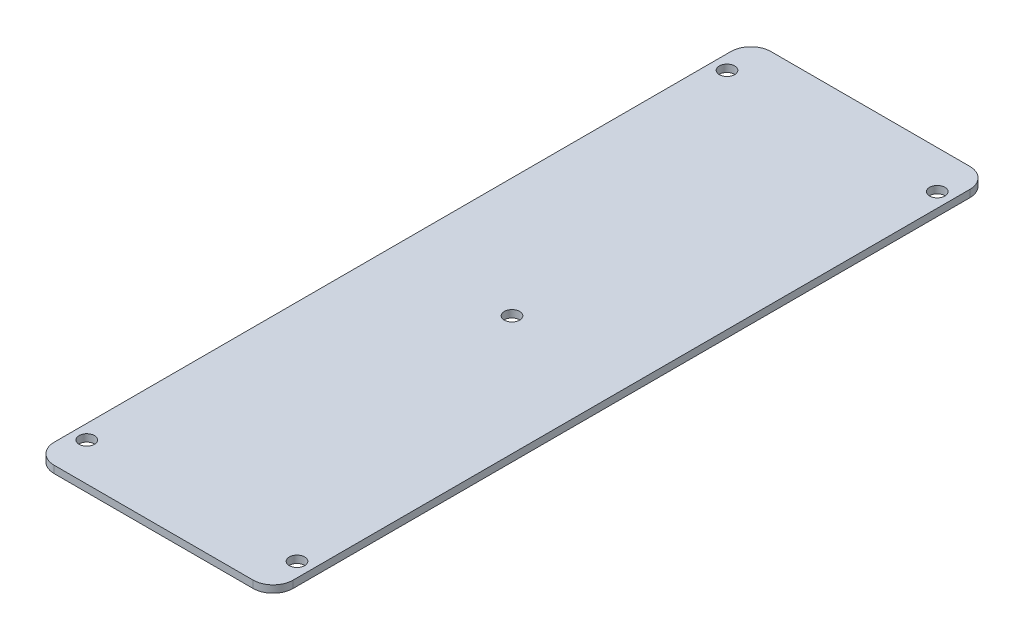
ISO-10303-21;
HEADER;
FILE_DESCRIPTION(('STEP AP214'),'2;1');
FILE_NAME('part.step','',(''),(''),'','','');
FILE_SCHEMA(('AUTOMOTIVE_DESIGN { 1 0 10303 214 1 1 1 1 }'));
ENDSEC;
DATA;
#1=APPLICATION_CONTEXT('core data for automotive mechanical design processes');
#2=APPLICATION_PROTOCOL_DEFINITION('international standard','automotive_design',2000,#1);
#3=PRODUCT_CONTEXT('',#1,'mechanical');
#4=PRODUCT('Part','Part','',(#3));
#5=PRODUCT_RELATED_PRODUCT_CATEGORY('part','',(#4));
#6=PRODUCT_DEFINITION_FORMATION('','',#4);
#7=PRODUCT_DEFINITION_CONTEXT('part definition',#1,'design');
#8=PRODUCT_DEFINITION('design','',#6,#7);
#9=PRODUCT_DEFINITION_SHAPE('','',#8);
#10=(LENGTH_UNIT() NAMED_UNIT(*) SI_UNIT(.MILLI.,.METRE.));
#11=(NAMED_UNIT(*) PLANE_ANGLE_UNIT() SI_UNIT($,.RADIAN.));
#12=(NAMED_UNIT(*) SI_UNIT($,.STERADIAN.) SOLID_ANGLE_UNIT());
#13=UNCERTAINTY_MEASURE_WITH_UNIT(LENGTH_MEASURE(1.E-05),#10,'distance_accuracy_value','');
#14=(GEOMETRIC_REPRESENTATION_CONTEXT(3) GLOBAL_UNCERTAINTY_ASSIGNED_CONTEXT((#13)) GLOBAL_UNIT_ASSIGNED_CONTEXT((#10,
#11,#12)) REPRESENTATION_CONTEXT('',''));
#15=CARTESIAN_POINT('',(0.,0.,0.));
#16=DIRECTION('',(0.,0.,1.));
#17=DIRECTION('',(1.,0.,0.));
#18=AXIS2_PLACEMENT_3D('',#15,#16,#17);
#19=CARTESIAN_POINT('',(3.00000000000004,-4.5254833995939,142.));
#20=DIRECTION('',(0.,1.,0.));
#21=DIRECTION('',(0.,0.,1.));
#22=AXIS2_PLACEMENT_3D('',#19,#20,#21);
#23=CYLINDRICAL_SURFACE('',#22,1.6);
#24=CARTESIAN_POINT('',(3.00000000000004,0.,142.));
#25=DIRECTION('',(0.,1.,0.));
#26=DIRECTION('',(0.,0.,1.));
#27=AXIS2_PLACEMENT_3D('',#24,#25,#26);
#28=CIRCLE('',#27,1.6);
#29=CARTESIAN_POINT('',(3.00000000000004,0.,143.6));
#30=VERTEX_POINT('',#29);
#31=EDGE_CURVE('E145',#30,#30,#28,.F.);
#32=ORIENTED_EDGE('',*,*,#31,.T.);
#33=EDGE_LOOP('',(#32));
#34=FACE_BOUND('',#33,.T.);
#35=CARTESIAN_POINT('',(3.00000000000004,1.524,142.));
#36=DIRECTION('',(0.,1.,0.));
#37=DIRECTION('',(0.,0.,1.));
#38=AXIS2_PLACEMENT_3D('',#35,#36,#37);
#39=CIRCLE('',#38,1.6);
#40=CARTESIAN_POINT('',(3.00000000000004,1.524,143.6));
#41=VERTEX_POINT('',#40);
#42=EDGE_CURVE('E148',#41,#41,#39,.T.);
#43=ORIENTED_EDGE('',*,*,#42,.T.);
#44=EDGE_LOOP('',(#43));
#45=FACE_BOUND('',#44,.T.);
#46=ADVANCED_FACE('F38',(#34,#45),#23,.F.);
#47=CARTESIAN_POINT('',(47.,-4.5254833995939,142.));
#48=DIRECTION('',(0.,1.,0.));
#49=DIRECTION('',(0.,0.,1.));
#50=AXIS2_PLACEMENT_3D('',#47,#48,#49);
#51=CYLINDRICAL_SURFACE('',#50,1.6);
#52=CARTESIAN_POINT('',(47.,0.,142.));
#53=DIRECTION('',(0.,1.,0.));
#54=DIRECTION('',(0.,0.,1.));
#55=AXIS2_PLACEMENT_3D('',#52,#53,#54);
#56=CIRCLE('',#55,1.6);
#57=CARTESIAN_POINT('',(47.,0.,143.6));
#58=VERTEX_POINT('',#57);
#59=EDGE_CURVE('E138',#58,#58,#56,.F.);
#60=ORIENTED_EDGE('',*,*,#59,.T.);
#61=EDGE_LOOP('',(#60));
#62=FACE_BOUND('',#61,.T.);
#63=CARTESIAN_POINT('',(47.,1.524,142.));
#64=DIRECTION('',(0.,1.,0.));
#65=DIRECTION('',(0.,0.,1.));
#66=AXIS2_PLACEMENT_3D('',#63,#64,#65);
#67=CIRCLE('',#66,1.6);
#68=CARTESIAN_POINT('',(47.,1.524,143.6));
#69=VERTEX_POINT('',#68);
#70=EDGE_CURVE('E141',#69,#69,#67,.T.);
#71=ORIENTED_EDGE('',*,*,#70,.T.);
#72=EDGE_LOOP('',(#71));
#73=FACE_BOUND('',#72,.T.);
#74=ADVANCED_FACE('F231',(#62,#73),#51,.F.);
#75=CARTESIAN_POINT('',(0.,1.524,0.));
#76=DIRECTION('',(1.,0.,0.));
#77=DIRECTION('',(0.,0.,-1.));
#78=AXIS2_PLACEMENT_3D('',#75,#76,#77);
#79=PLANE('',#78);
#80=DIRECTION('',(0.,0.,1.));
#81=VECTOR('',#80,1.);
#82=CARTESIAN_POINT('',(0.,0.,0.));
#83=LINE('',#82,#81);
#84=CARTESIAN_POINT('',(0.,0.,4.191));
#85=VERTEX_POINT('',#84);
#86=CARTESIAN_POINT('',(0.,0.,145.809));
#87=VERTEX_POINT('',#86);
#88=EDGE_CURVE('E134',#85,#87,#83,.T.);
#89=ORIENTED_EDGE('',*,*,#88,.T.);
#90=DIRECTION('',(0.,-1.,0.));
#91=VECTOR('',#90,1.);
#92=CARTESIAN_POINT('',(0.,1.524,145.809));
#93=LINE('',#92,#91);
#94=CARTESIAN_POINT('',(0.,1.524,145.809));
#95=VERTEX_POINT('',#94);
#96=EDGE_CURVE('E169',#87,#95,#93,.F.);
#97=ORIENTED_EDGE('',*,*,#96,.T.);
#98=DIRECTION('',(0.,0.,1.));
#99=VECTOR('',#98,1.);
#100=CARTESIAN_POINT('',(0.,1.524,0.));
#101=LINE('',#100,#99);
#102=CARTESIAN_POINT('',(0.,1.524,4.191));
#103=VERTEX_POINT('',#102);
#104=EDGE_CURVE('E132',#103,#95,#101,.T.);
#105=ORIENTED_EDGE('',*,*,#104,.F.);
#106=DIRECTION('',(0.,-1.,0.));
#107=VECTOR('',#106,1.);
#108=CARTESIAN_POINT('',(0.,1.524,4.191));
#109=LINE('',#108,#107);
#110=EDGE_CURVE('E166',#103,#85,#109,.T.);
#111=ORIENTED_EDGE('',*,*,#110,.T.);
#112=EDGE_LOOP('',(#89,#97,#105,#111));
#113=FACE_BOUND('',#112,.T.);
#114=ADVANCED_FACE('F182',(#113),#79,.F.);
#115=CARTESIAN_POINT('',(0.,1.524,150.));
#116=DIRECTION('',(0.,0.,-1.));
#117=DIRECTION('',(-1.,0.,0.));
#118=AXIS2_PLACEMENT_3D('',#115,#116,#117);
#119=PLANE('',#118);
#120=DIRECTION('',(1.,0.,0.));
#121=VECTOR('',#120,1.);
#122=CARTESIAN_POINT('',(0.,0.,150.));
#123=LINE('',#122,#121);
#124=CARTESIAN_POINT('',(4.19100000000002,0.,150.));
#125=VERTEX_POINT('',#124);
#126=CARTESIAN_POINT('',(45.809,0.,150.));
#127=VERTEX_POINT('',#126);
#128=EDGE_CURVE('E130',#125,#127,#123,.T.);
#129=ORIENTED_EDGE('',*,*,#128,.T.);
#130=DIRECTION('',(0.,-1.,0.));
#131=VECTOR('',#130,1.);
#132=CARTESIAN_POINT('',(45.809,1.524,150.));
#133=LINE('',#132,#131);
#134=CARTESIAN_POINT('',(45.809,1.524,150.));
#135=VERTEX_POINT('',#134);
#136=EDGE_CURVE('E108',#127,#135,#133,.F.);
#137=ORIENTED_EDGE('',*,*,#136,.T.);
#138=DIRECTION('',(1.,0.,0.));
#139=VECTOR('',#138,1.);
#140=CARTESIAN_POINT('',(0.,1.524,150.));
#141=LINE('',#140,#139);
#142=CARTESIAN_POINT('',(4.19100000000002,1.524,150.));
#143=VERTEX_POINT('',#142);
#144=EDGE_CURVE('E186',#143,#135,#141,.T.);
#145=ORIENTED_EDGE('',*,*,#144,.F.);
#146=DIRECTION('',(0.,-1.,0.));
#147=VECTOR('',#146,1.);
#148=CARTESIAN_POINT('',(4.19100000000002,1.524,150.));
#149=LINE('',#148,#147);
#150=EDGE_CURVE('E113',#143,#125,#149,.T.);
#151=ORIENTED_EDGE('',*,*,#150,.T.);
#152=EDGE_LOOP('',(#129,#137,#145,#151));
#153=FACE_BOUND('',#152,.T.);
#154=ADVANCED_FACE('F272',(#153),#119,.F.);
#155=CARTESIAN_POINT('',(50.,1.524,0.));
#156=DIRECTION('',(-1.,0.,0.));
#157=DIRECTION('',(0.,0.,1.));
#158=AXIS2_PLACEMENT_3D('',#155,#156,#157);
#159=PLANE('',#158);
#160=DIRECTION('',(0.,0.,-1.));
#161=VECTOR('',#160,1.);
#162=CARTESIAN_POINT('',(50.,1.524,0.));
#163=LINE('',#162,#161);
#164=CARTESIAN_POINT('',(50.,1.524,145.809));
#165=VERTEX_POINT('',#164);
#166=CARTESIAN_POINT('',(50.,1.524,4.191));
#167=VERTEX_POINT('',#166);
#168=EDGE_CURVE('E122',#165,#167,#163,.T.);
#169=ORIENTED_EDGE('',*,*,#168,.F.);
#170=DIRECTION('',(0.,-1.,0.));
#171=VECTOR('',#170,1.);
#172=CARTESIAN_POINT('',(50.,1.524,145.809));
#173=LINE('',#172,#171);
#174=CARTESIAN_POINT('',(50.,0.,145.809));
#175=VERTEX_POINT('',#174);
#176=EDGE_CURVE('E107',#165,#175,#173,.T.);
#177=ORIENTED_EDGE('',*,*,#176,.T.);
#178=DIRECTION('',(0.,0.,-1.));
#179=VECTOR('',#178,1.);
#180=CARTESIAN_POINT('',(50.,0.,0.));
#181=LINE('',#180,#179);
#182=CARTESIAN_POINT('',(50.,0.,4.191));
#183=VERTEX_POINT('',#182);
#184=EDGE_CURVE('E120',#175,#183,#181,.T.);
#185=ORIENTED_EDGE('',*,*,#184,.T.);
#186=DIRECTION('',(0.,-1.,0.));
#187=VECTOR('',#186,1.);
#188=CARTESIAN_POINT('',(50.,1.524,4.191));
#189=LINE('',#188,#187);
#190=EDGE_CURVE('E124',#183,#167,#189,.F.);
#191=ORIENTED_EDGE('',*,*,#190,.T.);
#192=EDGE_LOOP('',(#169,#177,#185,#191));
#193=FACE_BOUND('',#192,.T.);
#194=ADVANCED_FACE('F119',(#193),#159,.F.);
#195=CARTESIAN_POINT('',(0.,1.524,0.));
#196=DIRECTION('',(0.,0.,1.));
#197=DIRECTION('',(1.,0.,0.));
#198=AXIS2_PLACEMENT_3D('',#195,#196,#197);
#199=PLANE('',#198);
#200=DIRECTION('',(-1.,0.,0.));
#201=VECTOR('',#200,1.);
#202=CARTESIAN_POINT('',(0.,0.,0.));
#203=LINE('',#202,#201);
#204=CARTESIAN_POINT('',(45.809,0.,0.));
#205=VERTEX_POINT('',#204);
#206=CARTESIAN_POINT('',(4.191,0.,0.));
#207=VERTEX_POINT('',#206);
#208=EDGE_CURVE('E129',#205,#207,#203,.T.);
#209=ORIENTED_EDGE('',*,*,#208,.T.);
#210=DIRECTION('',(0.,-1.,0.));
#211=VECTOR('',#210,1.);
#212=CARTESIAN_POINT('',(4.191,1.524,0.));
#213=LINE('',#212,#211);
#214=CARTESIAN_POINT('',(4.191,1.524,0.));
#215=VERTEX_POINT('',#214);
#216=EDGE_CURVE('E11',#207,#215,#213,.F.);
#217=ORIENTED_EDGE('',*,*,#216,.T.);
#218=DIRECTION('',(-1.,0.,0.));
#219=VECTOR('',#218,1.);
#220=CARTESIAN_POINT('',(0.,1.524,0.));
#221=LINE('',#220,#219);
#222=CARTESIAN_POINT('',(45.809,1.524,0.));
#223=VERTEX_POINT('',#222);
#224=EDGE_CURVE('E142',#223,#215,#221,.T.);
#225=ORIENTED_EDGE('',*,*,#224,.F.);
#226=DIRECTION('',(0.,-1.,0.));
#227=VECTOR('',#226,1.);
#228=CARTESIAN_POINT('',(45.809,1.524,0.));
#229=LINE('',#228,#227);
#230=EDGE_CURVE('E46',#223,#205,#229,.T.);
#231=ORIENTED_EDGE('',*,*,#230,.T.);
#232=EDGE_LOOP('',(#209,#217,#225,#231));
#233=FACE_BOUND('',#232,.T.);
#234=ADVANCED_FACE('F172',(#233),#199,.F.);
#235=CARTESIAN_POINT('',(0.,1.524,0.));
#236=DIRECTION('',(0.,1.,0.));
#237=DIRECTION('',(0.,0.,1.));
#238=AXIS2_PLACEMENT_3D('',#235,#236,#237);
#239=PLANE('',#238);
#240=CARTESIAN_POINT('',(25.,1.524,75.));
#241=DIRECTION('',(0.,1.,0.));
#242=DIRECTION('',(0.,0.,1.));
#243=AXIS2_PLACEMENT_3D('',#240,#241,#242);
#244=CIRCLE('',#243,1.60000000000001);
#245=CARTESIAN_POINT('',(25.,1.524,76.6));
#246=VERTEX_POINT('',#245);
#247=EDGE_CURVE('E212',#246,#246,#244,.T.);
#248=ORIENTED_EDGE('',*,*,#247,.F.);
#249=EDGE_LOOP('',(#248));
#250=FACE_BOUND('',#249,.T.);
#251=CARTESIAN_POINT('',(3.00000000000002,1.524,8.00000000000001));
#252=DIRECTION('',(0.,1.,0.));
#253=DIRECTION('',(0.,0.,1.));
#254=AXIS2_PLACEMENT_3D('',#251,#252,#253);
#255=CIRCLE('',#254,1.6);
#256=CARTESIAN_POINT('',(3.00000000000002,1.524,9.6));
#257=VERTEX_POINT('',#256);
#258=EDGE_CURVE('E200',#257,#257,#255,.T.);
#259=ORIENTED_EDGE('',*,*,#258,.F.);
#260=EDGE_LOOP('',(#259));
#261=FACE_BOUND('',#260,.T.);
#262=CARTESIAN_POINT('',(47.,1.524,8.00000000000001));
#263=DIRECTION('',(0.,1.,0.));
#264=DIRECTION('',(0.,0.,1.));
#265=AXIS2_PLACEMENT_3D('',#262,#263,#264);
#266=CIRCLE('',#265,1.6);
#267=CARTESIAN_POINT('',(47.,1.524,9.6));
#268=VERTEX_POINT('',#267);
#269=EDGE_CURVE('E196',#268,#268,#266,.T.);
#270=ORIENTED_EDGE('',*,*,#269,.F.);
#271=EDGE_LOOP('',(#270));
#272=FACE_BOUND('',#271,.T.);
#273=ORIENTED_EDGE('',*,*,#144,.T.);
#274=CARTESIAN_POINT('',(45.809,1.524,145.809));
#275=DIRECTION('',(0.,1.,0.));
#276=DIRECTION('',(0.,0.,1.));
#277=AXIS2_PLACEMENT_3D('',#274,#275,#276);
#278=CIRCLE('',#277,4.191);
#279=EDGE_CURVE('E164',#135,#165,#278,.T.);
#280=ORIENTED_EDGE('',*,*,#279,.T.);
#281=ORIENTED_EDGE('',*,*,#168,.T.);
#282=CARTESIAN_POINT('',(45.809,1.524,4.191));
#283=DIRECTION('',(0.,1.,0.));
#284=DIRECTION('',(0.,0.,1.));
#285=AXIS2_PLACEMENT_3D('',#282,#283,#284);
#286=CIRCLE('',#285,4.191);
#287=EDGE_CURVE('E58',#167,#223,#286,.T.);
#288=ORIENTED_EDGE('',*,*,#287,.T.);
#289=ORIENTED_EDGE('',*,*,#224,.T.);
#290=CARTESIAN_POINT('',(4.191,1.524,4.191));
#291=DIRECTION('',(0.,1.,0.));
#292=DIRECTION('',(0.,0.,1.));
#293=AXIS2_PLACEMENT_3D('',#290,#291,#292);
#294=CIRCLE('',#293,4.191);
#295=EDGE_CURVE('E160',#215,#103,#294,.T.);
#296=ORIENTED_EDGE('',*,*,#295,.T.);
#297=ORIENTED_EDGE('',*,*,#104,.T.);
#298=CARTESIAN_POINT('',(4.19100000000002,1.524,145.809));
#299=DIRECTION('',(0.,1.,0.));
#300=DIRECTION('',(0.,0.,1.));
#301=AXIS2_PLACEMENT_3D('',#298,#299,#300);
#302=CIRCLE('',#301,4.191);
#303=EDGE_CURVE('E162',#95,#143,#302,.T.);
#304=ORIENTED_EDGE('',*,*,#303,.T.);
#305=EDGE_LOOP('',(#273,#280,#281,#288,#289,#296,#297,#304));
#306=FACE_BOUND('',#305,.T.);
#307=ORIENTED_EDGE('',*,*,#70,.F.);
#308=EDGE_LOOP('',(#307));
#309=FACE_BOUND('',#308,.T.);
#310=ORIENTED_EDGE('',*,*,#42,.F.);
#311=EDGE_LOOP('',(#310));
#312=FACE_BOUND('',#311,.T.);
#313=ADVANCED_FACE('F218',(#250,#261,#272,#306,#309,#312),#239,.T.);
#314=CARTESIAN_POINT('',(0.,0.,0.));
#315=DIRECTION('',(0.,1.,0.));
#316=DIRECTION('',(0.,0.,1.));
#317=AXIS2_PLACEMENT_3D('',#314,#315,#316);
#318=PLANE('',#317);
#319=CARTESIAN_POINT('',(25.,0.,75.));
#320=DIRECTION('',(0.,1.,0.));
#321=DIRECTION('',(0.,0.,1.));
#322=AXIS2_PLACEMENT_3D('',#319,#320,#321);
#323=CIRCLE('',#322,1.60000000000001);
#324=CARTESIAN_POINT('',(25.,0.,76.6));
#325=VERTEX_POINT('',#324);
#326=EDGE_CURVE('E209',#325,#325,#323,.F.);
#327=ORIENTED_EDGE('',*,*,#326,.F.);
#328=EDGE_LOOP('',(#327));
#329=FACE_BOUND('',#328,.T.);
#330=CARTESIAN_POINT('',(3.00000000000002,0.,8.00000000000001));
#331=DIRECTION('',(0.,1.,0.));
#332=DIRECTION('',(0.,0.,1.));
#333=AXIS2_PLACEMENT_3D('',#330,#331,#332);
#334=CIRCLE('',#333,1.6);
#335=CARTESIAN_POINT('',(3.00000000000002,0.,9.6));
#336=VERTEX_POINT('',#335);
#337=EDGE_CURVE('E204',#336,#336,#334,.F.);
#338=ORIENTED_EDGE('',*,*,#337,.F.);
#339=EDGE_LOOP('',(#338));
#340=FACE_BOUND('',#339,.T.);
#341=CARTESIAN_POINT('',(47.,0.,8.00000000000001));
#342=DIRECTION('',(0.,1.,0.));
#343=DIRECTION('',(0.,0.,1.));
#344=AXIS2_PLACEMENT_3D('',#341,#342,#343);
#345=CIRCLE('',#344,1.6);
#346=CARTESIAN_POINT('',(47.,0.,9.6));
#347=VERTEX_POINT('',#346);
#348=EDGE_CURVE('E191',#347,#347,#345,.F.);
#349=ORIENTED_EDGE('',*,*,#348,.F.);
#350=EDGE_LOOP('',(#349));
#351=FACE_BOUND('',#350,.T.);
#352=ORIENTED_EDGE('',*,*,#184,.F.);
#353=CARTESIAN_POINT('',(45.809,0.,145.809));
#354=DIRECTION('',(0.,1.,0.));
#355=DIRECTION('',(0.,0.,1.));
#356=AXIS2_PLACEMENT_3D('',#353,#354,#355);
#357=CIRCLE('',#356,4.191);
#358=EDGE_CURVE('E103',#175,#127,#357,.F.);
#359=ORIENTED_EDGE('',*,*,#358,.T.);
#360=ORIENTED_EDGE('',*,*,#128,.F.);
#361=CARTESIAN_POINT('',(4.19100000000002,0.,145.809));
#362=DIRECTION('',(0.,1.,0.));
#363=DIRECTION('',(0.,0.,1.));
#364=AXIS2_PLACEMENT_3D('',#361,#362,#363);
#365=CIRCLE('',#364,4.191);
#366=EDGE_CURVE('E114',#125,#87,#365,.F.);
#367=ORIENTED_EDGE('',*,*,#366,.T.);
#368=ORIENTED_EDGE('',*,*,#88,.F.);
#369=CARTESIAN_POINT('',(4.191,0.,4.191));
#370=DIRECTION('',(0.,1.,0.));
#371=DIRECTION('',(0.,0.,1.));
#372=AXIS2_PLACEMENT_3D('',#369,#370,#371);
#373=CIRCLE('',#372,4.191);
#374=EDGE_CURVE('E153',#85,#207,#373,.F.);
#375=ORIENTED_EDGE('',*,*,#374,.T.);
#376=ORIENTED_EDGE('',*,*,#208,.F.);
#377=CARTESIAN_POINT('',(45.809,0.,4.191));
#378=DIRECTION('',(0.,1.,0.));
#379=DIRECTION('',(0.,0.,1.));
#380=AXIS2_PLACEMENT_3D('',#377,#378,#379);
#381=CIRCLE('',#380,4.191);
#382=EDGE_CURVE('E123',#205,#183,#381,.F.);
#383=ORIENTED_EDGE('',*,*,#382,.T.);
#384=EDGE_LOOP('',(#352,#359,#360,#367,#368,#375,#376,#383));
#385=FACE_BOUND('',#384,.T.);
#386=ORIENTED_EDGE('',*,*,#59,.F.);
#387=EDGE_LOOP('',(#386));
#388=FACE_BOUND('',#387,.T.);
#389=ORIENTED_EDGE('',*,*,#31,.F.);
#390=EDGE_LOOP('',(#389));
#391=FACE_BOUND('',#390,.T.);
#392=ADVANCED_FACE('F126',(#329,#340,#351,#385,#388,#391),#318,.F.);
#393=CARTESIAN_POINT('',(47.,-4.5254833995939,8.00000000000001));
#394=DIRECTION('',(0.,1.,0.));
#395=DIRECTION('',(0.,0.,1.));
#396=AXIS2_PLACEMENT_3D('',#393,#394,#395);
#397=CYLINDRICAL_SURFACE('',#396,1.6);
#398=ORIENTED_EDGE('',*,*,#348,.T.);
#399=EDGE_LOOP('',(#398));
#400=FACE_BOUND('',#399,.T.);
#401=ORIENTED_EDGE('',*,*,#269,.T.);
#402=EDGE_LOOP('',(#401));
#403=FACE_BOUND('',#402,.T.);
#404=ADVANCED_FACE('F261',(#400,#403),#397,.F.);
#405=CARTESIAN_POINT('',(3.00000000000002,-4.5254833995939,8.00000000000001));
#406=DIRECTION('',(0.,1.,0.));
#407=DIRECTION('',(0.,0.,1.));
#408=AXIS2_PLACEMENT_3D('',#405,#406,#407);
#409=CYLINDRICAL_SURFACE('',#408,1.6);
#410=ORIENTED_EDGE('',*,*,#337,.T.);
#411=EDGE_LOOP('',(#410));
#412=FACE_BOUND('',#411,.T.);
#413=ORIENTED_EDGE('',*,*,#258,.T.);
#414=EDGE_LOOP('',(#413));
#415=FACE_BOUND('',#414,.T.);
#416=ADVANCED_FACE('F244',(#412,#415),#409,.F.);
#417=CARTESIAN_POINT('',(45.809,1.524,145.809));
#418=DIRECTION('',(0.,-1.,0.));
#419=DIRECTION('',(0.,0.,-1.));
#420=AXIS2_PLACEMENT_3D('',#417,#418,#419);
#421=CYLINDRICAL_SURFACE('',#420,4.191);
#422=ORIENTED_EDGE('',*,*,#279,.F.);
#423=ORIENTED_EDGE('',*,*,#136,.F.);
#424=ORIENTED_EDGE('',*,*,#358,.F.);
#425=ORIENTED_EDGE('',*,*,#176,.F.);
#426=EDGE_LOOP('',(#422,#423,#424,#425));
#427=FACE_BOUND('',#426,.T.);
#428=ADVANCED_FACE('F106',(#427),#421,.T.);
#429=CARTESIAN_POINT('',(4.19100000000002,1.524,145.809));
#430=DIRECTION('',(0.,-1.,0.));
#431=DIRECTION('',(0.,0.,-1.));
#432=AXIS2_PLACEMENT_3D('',#429,#430,#431);
#433=CYLINDRICAL_SURFACE('',#432,4.191);
#434=ORIENTED_EDGE('',*,*,#303,.F.);
#435=ORIENTED_EDGE('',*,*,#96,.F.);
#436=ORIENTED_EDGE('',*,*,#366,.F.);
#437=ORIENTED_EDGE('',*,*,#150,.F.);
#438=EDGE_LOOP('',(#434,#435,#436,#437));
#439=FACE_BOUND('',#438,.T.);
#440=ADVANCED_FACE('F243',(#439),#433,.T.);
#441=CARTESIAN_POINT('',(4.191,1.524,4.191));
#442=DIRECTION('',(0.,-1.,0.));
#443=DIRECTION('',(0.,0.,-1.));
#444=AXIS2_PLACEMENT_3D('',#441,#442,#443);
#445=CYLINDRICAL_SURFACE('',#444,4.191);
#446=ORIENTED_EDGE('',*,*,#295,.F.);
#447=ORIENTED_EDGE('',*,*,#216,.F.);
#448=ORIENTED_EDGE('',*,*,#374,.F.);
#449=ORIENTED_EDGE('',*,*,#110,.F.);
#450=EDGE_LOOP('',(#446,#447,#448,#449));
#451=FACE_BOUND('',#450,.T.);
#452=ADVANCED_FACE('F179',(#451),#445,.T.);
#453=CARTESIAN_POINT('',(45.809,1.524,4.191));
#454=DIRECTION('',(0.,-1.,0.));
#455=DIRECTION('',(0.,0.,-1.));
#456=AXIS2_PLACEMENT_3D('',#453,#454,#455);
#457=CYLINDRICAL_SURFACE('',#456,4.191);
#458=ORIENTED_EDGE('',*,*,#287,.F.);
#459=ORIENTED_EDGE('',*,*,#190,.F.);
#460=ORIENTED_EDGE('',*,*,#382,.F.);
#461=ORIENTED_EDGE('',*,*,#230,.F.);
#462=EDGE_LOOP('',(#458,#459,#460,#461));
#463=FACE_BOUND('',#462,.T.);
#464=ADVANCED_FACE('F40',(#463),#457,.T.);
#465=CARTESIAN_POINT('',(25.,-4.52548339959392,75.));
#466=DIRECTION('',(0.,1.,0.));
#467=DIRECTION('',(0.,0.,1.));
#468=AXIS2_PLACEMENT_3D('',#465,#466,#467);
#469=CYLINDRICAL_SURFACE('',#468,1.60000000000001);
#470=ORIENTED_EDGE('',*,*,#326,.T.);
#471=EDGE_LOOP('',(#470));
#472=FACE_BOUND('',#471,.T.);
#473=ORIENTED_EDGE('',*,*,#247,.T.);
#474=EDGE_LOOP('',(#473));
#475=FACE_BOUND('',#474,.T.);
#476=ADVANCED_FACE('F216',(#472,#475),#469,.F.);
#477=CLOSED_SHELL('',(#46,#74,#114,#154,#194,#234,#313,#392,#404,#416,#428,#440,#452,#464,#476));
#478=MANIFOLD_SOLID_BREP('B2',#477);
#479=ADVANCED_BREP_SHAPE_REPRESENTATION('',(#18,#478),#14);
#480=SHAPE_DEFINITION_REPRESENTATION(#9,#479);
ENDSEC;
END-ISO-10303-21;
